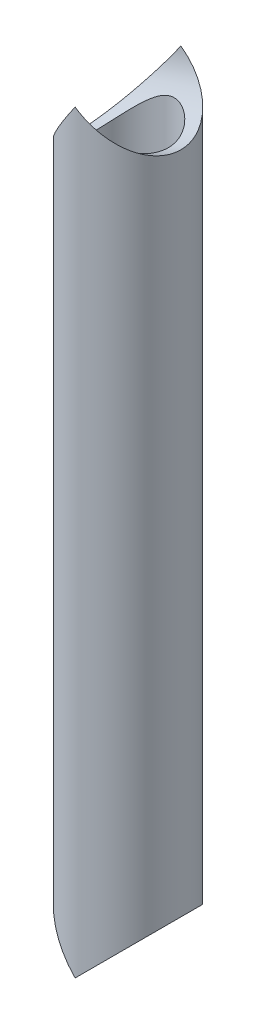
ISO-10303-21;
HEADER;
FILE_DESCRIPTION(('STEP AP214'),'2;1');
FILE_NAME('part.step','',(''),(''),'','','');
FILE_SCHEMA(('AUTOMOTIVE_DESIGN { 1 0 10303 214 1 1 1 1 }'));
ENDSEC;
DATA;
#1=APPLICATION_CONTEXT('core data for automotive mechanical design processes');
#2=APPLICATION_PROTOCOL_DEFINITION('international standard','automotive_design',2000,#1);
#3=PRODUCT_CONTEXT('',#1,'mechanical');
#4=PRODUCT('Part','Part','',(#3));
#5=PRODUCT_RELATED_PRODUCT_CATEGORY('part','',(#4));
#6=PRODUCT_DEFINITION_FORMATION('','',#4);
#7=PRODUCT_DEFINITION_CONTEXT('part definition',#1,'design');
#8=PRODUCT_DEFINITION('design','',#6,#7);
#9=PRODUCT_DEFINITION_SHAPE('','',#8);
#10=(LENGTH_UNIT() NAMED_UNIT(*) SI_UNIT(.MILLI.,.METRE.));
#11=(NAMED_UNIT(*) PLANE_ANGLE_UNIT() SI_UNIT($,.RADIAN.));
#12=(NAMED_UNIT(*) SI_UNIT($,.STERADIAN.) SOLID_ANGLE_UNIT());
#13=UNCERTAINTY_MEASURE_WITH_UNIT(LENGTH_MEASURE(1.E-05),#10,'distance_accuracy_value','');
#14=(GEOMETRIC_REPRESENTATION_CONTEXT(3) GLOBAL_UNCERTAINTY_ASSIGNED_CONTEXT((#13)) GLOBAL_UNIT_ASSIGNED_CONTEXT((#10,
#11,#12)) REPRESENTATION_CONTEXT('',''));
#15=CARTESIAN_POINT('',(0.,0.,0.));
#16=DIRECTION('',(0.,0.,1.));
#17=DIRECTION('',(1.,0.,0.));
#18=AXIS2_PLACEMENT_3D('',#15,#16,#17);
#19=CARTESIAN_POINT('',(2299.99999999996,181.249999999997,-275.000000000001));
#20=DIRECTION('',(0.,-1.,0.));
#21=DIRECTION('',(0.,0.,-1.));
#22=AXIS2_PLACEMENT_3D('',#19,#20,#21);
#23=CYLINDRICAL_SURFACE('',#22,12.6999999999999);
#24=CARTESIAN_POINT('',(2299.99999999996,181.249999999996,-275.000000000001));
#25=DIRECTION('',(0.818779373097968,-0.57410829831078,0.));
#26=DIRECTION('',(-0.574108298310781,-0.818779373097967,0.));
#27=AXIS2_PLACEMENT_3D('',#24,#25,#26);
#28=ELLIPSE('',#27,22.1212618548932,12.6999999999999);
#29=CARTESIAN_POINT('',(2299.99999999996,181.249999999997,-287.700000000001));
#30=VERTEX_POINT('',#29);
#31=CARTESIAN_POINT('',(2299.99999999996,181.249999999997,-262.300000000001));
#32=VERTEX_POINT('',#31);
#33=EDGE_CURVE('E56',#30,#32,#28,.F.);
#34=ORIENTED_EDGE('',*,*,#33,.F.);
#35=CARTESIAN_POINT('',(2299.99999999996,181.249999999996,-275.000000000001));
#36=DIRECTION('',(-0.574108298310781,-0.818779373097967,0.));
#37=DIRECTION('',(0.818779373097968,-0.57410829831078,0.));
#38=AXIS2_PLACEMENT_3D('',#35,#36,#37);
#39=ELLIPSE('',#38,15.5108939199918,12.6999999999999);
#40=EDGE_CURVE('E91',#32,#30,#39,.F.);
#41=ORIENTED_EDGE('',*,*,#40,.F.);
#42=EDGE_LOOP('',(#34,#41));
#43=FACE_BOUND('',#42,.T.);
#44=CARTESIAN_POINT('',(2299.99999999996,-1.51267887105178E-12,-275.000000000001));
#45=DIRECTION('',(0.70710678118655,-0.707106781186546,0.));
#46=DIRECTION('',(-0.707106781186546,-0.707106781186549,0.));
#47=AXIS2_PLACEMENT_3D('',#44,#45,#46);
#48=ELLIPSE('',#47,17.9605122421383,12.6999999999999);
#49=CARTESIAN_POINT('',(2299.99999999996,-1.5404344466674E-12,-287.700000000001));
#50=VERTEX_POINT('',#49);
#51=CARTESIAN_POINT('',(2299.99999999996,-4.16333634234434E-12,-262.300000000001));
#52=VERTEX_POINT('',#51);
#53=EDGE_CURVE('E73',#50,#52,#48,.T.);
#54=ORIENTED_EDGE('',*,*,#53,.F.);
#55=CARTESIAN_POINT('',(2299.99999999996,-1.51267887105178E-12,-275.000000000001));
#56=DIRECTION('',(-0.707106781186546,-0.707106781186549,0.));
#57=DIRECTION('',(0.70710678118655,-0.707106781186546,0.));
#58=AXIS2_PLACEMENT_3D('',#55,#56,#57);
#59=ELLIPSE('',#58,17.9605122421382,12.6999999999999);
#60=EDGE_CURVE('E80',#52,#50,#59,.T.);
#61=ORIENTED_EDGE('',*,*,#60,.F.);
#62=EDGE_LOOP('',(#54,#61));
#63=FACE_BOUND('',#62,.T.);
#64=ADVANCED_FACE('F42',(#43,#63),#23,.T.);
#65=CARTESIAN_POINT('',(1799.99999999996,-4.20496970576778E-12,-275.000000000001));
#66=DIRECTION('',(0.940136065162483,0.3407993236214,0.));
#67=DIRECTION('',(-0.3407993236214,0.940136065162483,0.));
#68=AXIS2_PLACEMENT_3D('',#65,#66,#67);
#69=CYLINDRICAL_SURFACE('',#68,12.7);
#70=CARTESIAN_POINT('',(2299.99999999996,172.467908247635,-284.650000000001));
#71=CARTESIAN_POINT('',(2299.73053482446,172.370218189027,-284.649997759306));
#72=CARTESIAN_POINT('',(2299.46554248098,172.260056766113,-284.638694372456));
#73=CARTESIAN_POINT('',(2298.94662265408,172.019153605129,-284.595878168783));
#74=CARTESIAN_POINT('',(2298.69270935676,171.888386416019,-284.564340209438));
#75=CARTESIAN_POINT('',(2298.1952072461,171.610087485636,-284.483098979186));
#76=CARTESIAN_POINT('',(2297.95169548143,171.46245317265,-284.433279994711));
#77=CARTESIAN_POINT('',(2297.4764958178,171.15532292964,-284.317415065042));
#78=CARTESIAN_POINT('',(2297.24480572008,170.99582921905,-284.251372150784));
#79=CARTESIAN_POINT('',(2296.70031175359,170.60176101783,-284.07450685215));
#80=CARTESIAN_POINT('',(2296.39287128243,170.36304733443,-283.956398954751));
#81=CARTESIAN_POINT('',(2295.79746676399,169.876438195739,-283.692940414183));
#82=CARTESIAN_POINT('',(2295.50951387501,169.628537603784,-283.547574340008));
#83=CARTESIAN_POINT('',(2294.95184407707,169.129663568345,-283.230515777692));
#84=CARTESIAN_POINT('',(2294.68211252106,168.878692789196,-283.058844806216));
#85=CARTESIAN_POINT('',(2294.16001321391,168.378499187879,-282.688911920102));
#86=CARTESIAN_POINT('',(2293.9076385082,168.129275701977,-282.490660750671));
#87=CARTESIAN_POINT('',(2293.46834534704,167.685553799704,-282.108252687632));
#88=CARTESIAN_POINT('',(2293.27830943162,167.489924907236,-281.928981075182));
#89=CARTESIAN_POINT('',(2292.91021399962,167.105291024418,-281.551861442901));
#90=CARTESIAN_POINT('',(2292.73215545709,166.916286573392,-281.354011915367));
#91=CARTESIAN_POINT('',(2292.38954262194,166.548141986001,-280.939324997215));
#92=CARTESIAN_POINT('',(2292.22496102757,166.368982161477,-280.722527931348));
#93=CARTESIAN_POINT('',(2291.91073877806,166.023518665575,-280.269013329519));
#94=CARTESIAN_POINT('',(2291.76109145339,165.857209262865,-280.032304773692));
#95=CARTESIAN_POINT('',(2291.42811875588,165.484212809176,-279.449133380189));
#96=CARTESIAN_POINT('',(2291.25201934174,165.28449610461,-279.093800231935));
#97=CARTESIAN_POINT('',(2291.01788618172,165.017004988662,-278.533432042647));
#98=CARTESIAN_POINT('',(2290.94485426117,164.93320005845,-278.342115872068));
#99=CARTESIAN_POINT('',(2290.80987402723,164.777818732797,-277.950741999339));
#100=CARTESIAN_POINT('',(2290.74792389831,164.706240334358,-277.750685735781));
#101=CARTESIAN_POINT('',(2290.64532866594,164.587410751901,-277.375727045156));
#102=CARTESIAN_POINT('',(2290.60285878446,164.53809782102,-277.201974600978));
#103=CARTESIAN_POINT('',(2290.52724317586,164.450159626415,-276.849808707908));
#104=CARTESIAN_POINT('',(2290.49409554138,164.411532176434,-276.671396220652));
#105=CARTESIAN_POINT('',(2290.43772976295,164.345777021796,-276.311004460584));
#106=CARTESIAN_POINT('',(2290.41450644775,164.318643328177,-276.129027097142));
#107=CARTESIAN_POINT('',(2290.37842269942,164.276458788866,-275.762646568441));
#108=CARTESIAN_POINT('',(2290.365562346,164.261408036111,-275.578243384535));
#109=CARTESIAN_POINT('',(2290.35045422322,164.243724881254,-275.207875761226));
#110=CARTESIAN_POINT('',(2290.34823683894,164.241128034375,-275.021908368404));
#111=CARTESIAN_POINT('',(2290.3545451394,164.248513004529,-274.650407901026));
#112=CARTESIAN_POINT('',(2290.36307085271,164.258494855011,-274.464874827626));
#113=CARTESIAN_POINT('',(2290.39068647275,164.290798807495,-274.095631182327));
#114=CARTESIAN_POINT('',(2290.40977958537,164.313124654349,-273.911921180728));
#115=CARTESIAN_POINT('',(2290.45814082542,164.36959754008,-273.547698809239));
#116=CARTESIAN_POINT('',(2290.48740903575,164.403744675258,-273.367186465411));
#117=CARTESIAN_POINT('',(2290.55434681284,164.481697765372,-273.01687371838));
#118=CARTESIAN_POINT('',(2290.59167801869,164.525114076771,-272.846921196638));
#119=CARTESIAN_POINT('',(2290.67470231858,164.62145879688,-272.51179726154));
#120=CARTESIAN_POINT('',(2290.7203979906,164.674390138094,-272.346627340442));
#121=CARTESIAN_POINT('',(2290.8690598963,164.846137884352,-271.859354085998));
#122=CARTESIAN_POINT('',(2290.98363651566,164.977949601629,-271.545306792955));
#123=CARTESIAN_POINT('',(2291.31041125978,165.35107940232,-270.772028486017));
#124=CARTESIAN_POINT('',(2291.54129786457,165.612324908465,-270.33030385345));
#125=CARTESIAN_POINT('',(2291.92329019123,166.037194799253,-269.713398596103));
#126=CARTESIAN_POINT('',(2292.05684633344,166.184623291186,-269.515051232876));
#127=CARTESIAN_POINT('',(2292.33466133954,166.488321702911,-269.133078115759));
#128=CARTESIAN_POINT('',(2292.47891986943,166.644591346763,-268.94945190284));
#129=CARTESIAN_POINT('',(2292.84455761016,167.036171481727,-268.516565852519));
#130=CARTESIAN_POINT('',(2293.0712854897,167.275238390509,-268.275225365091));
#131=CARTESIAN_POINT('',(2293.54309049028,167.76229425933,-267.820995665739));
#132=CARTESIAN_POINT('',(2293.78817765643,168.010288064522,-267.608122209324));
#133=CARTESIAN_POINT('',(2294.29602912652,168.510492327589,-267.209523819256));
#134=CARTESIAN_POINT('',(2294.55880902725,168.762706354603,-267.023823309438));
#135=CARTESIAN_POINT('',(2295.10199813402,169.266241985688,-266.679210978262));
#136=CARTESIAN_POINT('',(2295.3823999999,169.517563915863,-266.520288103288));
#137=CARTESIAN_POINT('',(2295.88312564491,169.946335024737,-266.26905215604));
#138=CARTESIAN_POINT('',(2296.09901438737,170.125262695582,-266.170385637131));
#139=CARTESIAN_POINT('',(2296.54158878963,170.477335026015,-265.987829743365));
#140=CARTESIAN_POINT('',(2296.76827515228,170.650479307888,-265.903941332144));
#141=CARTESIAN_POINT('',(2297.23271049986,170.987508301407,-265.752072536941));
#142=CARTESIAN_POINT('',(2297.47043127628,171.151414482954,-265.684054007376));
#143=CARTESIAN_POINT('',(2297.95819292835,171.466641412139,-265.565145386283));
#144=CARTESIAN_POINT('',(2298.20822810032,171.617967900637,-265.514247448949));
#145=CARTESIAN_POINT('',(2298.63986546246,171.858377782197,-265.444685248814));
#146=CARTESIAN_POINT('',(2298.8181143464,171.952015177421,-265.420917602166));
#147=CARTESIAN_POINT('',(2299.18032461408,172.129673692137,-265.383151750566));
#148=CARTESIAN_POINT('',(2299.36428407882,172.213697998511,-265.369150300084));
#149=CARTESIAN_POINT('',(2299.73718388123,172.370416599529,-265.351777100898));
#150=CARTESIAN_POINT('',(2299.92611672571,172.443126912917,-265.348390191191));
#151=CARTESIAN_POINT('',(2300.30827256465,172.575886347668,-265.35303313427));
#152=CARTESIAN_POINT('',(2300.50149544033,172.635935819132,-265.361062671318));
#153=CARTESIAN_POINT('',(2300.89241144788,172.742704146845,-265.389339259386));
#154=CARTESIAN_POINT('',(2301.09012801355,172.789312119353,-265.409683871265));
#155=CARTESIAN_POINT('',(2301.48672693155,172.868035297717,-265.463115115684));
#156=CARTESIAN_POINT('',(2301.68560928388,172.90015050359,-265.496201748208));
#157=CARTESIAN_POINT('',(2302.08273056967,172.950131055175,-265.57525856253));
#158=CARTESIAN_POINT('',(2302.2809689797,172.967986791114,-265.621237404525));
#159=CARTESIAN_POINT('',(2302.6748151356,172.990337576116,-265.725875317573));
#160=CARTESIAN_POINT('',(2302.87042282271,172.994832327219,-265.784534671379));
#161=CARTESIAN_POINT('',(2303.23962355314,172.992041803571,-265.908153032472));
#162=CARTESIAN_POINT('',(2303.41358786701,172.985801033579,-265.972037872669));
#163=CARTESIAN_POINT('',(2303.75713296598,172.964784037057,-266.109514572788));
#164=CARTESIAN_POINT('',(2303.92671213693,172.950004712946,-266.183109947975));
#165=CARTESIAN_POINT('',(2304.42784557373,172.894881000918,-266.41788967582));
#166=CARTESIAN_POINT('',(2304.75180715099,172.843750616685,-266.593071461264));
#167=CARTESIAN_POINT('',(2305.29455959348,172.738691671621,-266.927569865762));
#168=CARTESIAN_POINT('',(2305.51894260648,172.688877981324,-267.079345713224));
#169=CARTESIAN_POINT('',(2305.9533140424,172.582717481231,-267.400431113796));
#170=CARTESIAN_POINT('',(2306.1632974197,172.526368399866,-267.569746761184));
#171=CARTESIAN_POINT('',(2306.56805994898,172.410216054049,-267.924994202727));
#172=CARTESIAN_POINT('',(2306.76282201821,172.350409036068,-268.110944177614));
#173=CARTESIAN_POINT('',(2307.1360210879,172.230065475426,-268.498306765165));
#174=CARTESIAN_POINT('',(2307.31445975823,172.169529008104,-268.69971779229));
#175=CARTESIAN_POINT('',(2307.65542013288,172.04955086513,-269.118627955483));
#176=CARTESIAN_POINT('',(2307.81780830623,171.990121251027,-269.336239300013));
#177=CARTESIAN_POINT('',(2308.12407224244,171.874876942633,-269.785045492319));
#178=CARTESIAN_POINT('',(2308.26794760491,171.819062326536,-270.01624063372));
#179=CARTESIAN_POINT('',(2308.53601675936,171.712858274085,-270.490773445517));
#180=CARTESIAN_POINT('',(2308.6602231113,171.662465382248,-270.734103235526));
#181=CARTESIAN_POINT('',(2308.88797143843,171.568601012514,-271.231541280481));
#182=CARTESIAN_POINT('',(2308.99151404021,171.525129324751,-271.485649208313));
#183=CARTESIAN_POINT('',(2309.17596447705,171.446803545576,-272.000309645774));
#184=CARTESIAN_POINT('',(2309.25708937214,171.411867223489,-272.260771700066));
#185=CARTESIAN_POINT('',(2309.39717759498,171.351074650212,-272.788640060479));
#186=CARTESIAN_POINT('',(2309.45614087054,171.325218420398,-273.056046382947));
#187=CARTESIAN_POINT('',(2309.55118338372,171.283354255913,-273.595577187641));
#188=CARTESIAN_POINT('',(2309.58726964824,171.267343297212,-273.867700194679));
#189=CARTESIAN_POINT('',(2309.63612579955,171.245633474846,-274.414432680925));
#190=CARTESIAN_POINT('',(2309.64889736631,171.239933868183,-274.689041979547));
#191=CARTESIAN_POINT('',(2309.65088296246,171.239048242282,-275.216286119155));
#192=CARTESIAN_POINT('',(2309.64190620818,171.243054778942,-275.468914908257));
#193=CARTESIAN_POINT('',(2309.60420102593,171.25982506276,-275.972388783244));
#194=CARTESIAN_POINT('',(2309.57547380336,171.272588275492,-276.223233977039));
#195=CARTESIAN_POINT('',(2309.49858332921,171.306549698006,-276.721310895051));
#196=CARTESIAN_POINT('',(2309.4504222859,171.327746949419,-276.968543026516));
#197=CARTESIAN_POINT('',(2309.33516071545,171.378048039254,-277.457727559054));
#198=CARTESIAN_POINT('',(2309.26805983618,171.407152024675,-277.699679861876));
#199=CARTESIAN_POINT('',(2309.11609287312,171.472318525363,-278.175090948703));
#200=CARTESIAN_POINT('',(2309.03135271699,171.508331580853,-278.408596860839));
#201=CARTESIAN_POINT('',(2308.84456786848,171.586563518522,-278.867491595145));
#202=CARTESIAN_POINT('',(2308.7425233619,171.628782334068,-279.092880504438));
#203=CARTESIAN_POINT('',(2308.52188363618,171.718402201551,-279.534416350076));
#204=CARTESIAN_POINT('',(2308.40328306147,171.765804929307,-279.750560266165));
#205=CARTESIAN_POINT('',(2308.15035595184,171.864588914034,-280.172495483765));
#206=CARTESIAN_POINT('',(2308.01602824801,171.915970466636,-280.378286014133));
#207=CARTESIAN_POINT('',(2307.72198117068,172.025241981729,-280.793347092175));
#208=CARTESIAN_POINT('',(2307.56112013454,172.083332540011,-281.001756696156));
#209=CARTESIAN_POINT('',(2307.22308401382,172.200635477715,-281.404584734734));
#210=CARTESIAN_POINT('',(2307.04590728267,172.259847969885,-281.599001753662));
#211=CARTESIAN_POINT('',(2306.67602514394,172.377219563241,-281.972975644404));
#212=CARTESIAN_POINT('',(2306.48331318166,172.435378206973,-282.152526178222));
#213=CARTESIAN_POINT('',(2306.0832488222,172.548061362866,-282.495733766435));
#214=CARTESIAN_POINT('',(2305.87589869451,172.602586435834,-282.65939327525));
#215=CARTESIAN_POINT('',(2305.47957070307,172.697326296517,-282.946531596886));
#216=CARTESIAN_POINT('',(2305.29250807008,172.738460546252,-283.072354015057));
#217=CARTESIAN_POINT('',(2304.9090248277,172.8138345128,-283.311135434399));
#218=CARTESIAN_POINT('',(2304.71260588048,172.848075448621,-283.424096708387));
#219=CARTESIAN_POINT('',(2304.31147985033,172.907271483493,-283.636263101621));
#220=CARTESIAN_POINT('',(2304.10678568848,172.932240482794,-283.735488671849));
#221=CARTESIAN_POINT('',(2303.68996362096,172.970437408307,-283.919558771418));
#222=CARTESIAN_POINT('',(2303.47783756582,172.98366823601,-284.004406850452));
#223=CARTESIAN_POINT('',(2303.08608674462,172.994805726513,-284.145153786568));
#224=CARTESIAN_POINT('',(2302.90741147709,172.995024265337,-284.203516869633));
#225=CARTESIAN_POINT('',(2302.54726008047,172.984624801551,-284.309628681743));
#226=CARTESIAN_POINT('',(2302.36578458159,172.974009203211,-284.357379762901));
#227=CARTESIAN_POINT('',(2302.00158871129,172.941034164224,-284.441983273501));
#228=CARTESIAN_POINT('',(2301.81887013265,172.918689094121,-284.478848953192));
#229=CARTESIAN_POINT('',(2301.45352041814,172.861792199778,-284.541704668761));
#230=CARTESIAN_POINT('',(2301.2708892728,172.827244186212,-284.567698094244));
#231=CARTESIAN_POINT('',(2300.90500623726,172.745502459949,-284.609253783223));
#232=CARTESIAN_POINT('',(2300.72177211717,172.698165416768,-284.624690345882));
#233=CARTESIAN_POINT('',(2300.35837474745,172.591667069626,-284.645060112606));
#234=CARTESIAN_POINT('',(2300.17820921882,172.532514996919,-284.650001481872));
#235=CARTESIAN_POINT('',(2299.99999999996,172.467908247635,-284.650000000001));
#236=B_SPLINE_CURVE_WITH_KNOTS('',3,(#70,#71,#72,#73,#74,#75,#76,#77,#78,#79,#80,#81,#82,#83,
#84,#85,#86,#87,#88,#89,#90,#91,#92,#93,#94,#95,#96,#97,#98,#99,#100,#101,#102,#103,#104,#105,
#106,#107,#108,#109,#110,#111,#112,#113,#114,#115,#116,#117,#118,#119,#120,#121,#122,#123,#124,
#125,#126,#127,#128,#129,#130,#131,#132,#133,#134,#135,#136,#137,#138,#139,#140,#141,#142,#143,
#144,#145,#146,#147,#148,#149,#150,#151,#152,#153,#154,#155,#156,#157,#158,#159,#160,#161,#162,
#163,#164,#165,#166,#167,#168,#169,#170,#171,#172,#173,#174,#175,#176,#177,#178,#179,#180,#181,
#182,#183,#184,#185,#186,#187,#188,#189,#190,#191,#192,#193,#194,#195,#196,#197,#198,#199,#200,
#201,#202,#203,#204,#205,#206,#207,#208,#209,#210,#211,#212,#213,#214,#215,#216,#217,#218,#219,
#220,#221,#222,#223,#224,#225,#226,#227,#228,#229,#230,#231,#232,#233,#234,#235),.UNSPECIFIED.,
.T.,.F.,(4,2,2,2,2,2,2,2,2,2,2,2,2,2,2,2,2,2,2,2,2,2,2,2,2,2,2,2,2,2,2,2,2,2,2,2,2,2,2,2,2,2,2,
2,2,2,2,2,2,2,2,2,2,2,2,2,2,2,2,2,2,2,2,2,2,2,2,2,2,2,2,2,2,2,2,2,2,2,2,2,2,2,4),(0.,
0.85956480092131,1.72019973033594,2.58637893968347,3.45239645340109,4.67086270441151,
5.89002082984862,7.10818698994395,8.32586217554469,9.30426642642538,10.2827501491396,
11.2591999090223,12.2352116246843,13.5620039284862,14.2251760081481,14.8882393400177,
15.4443119321435,16.0002706671357,16.555939355651,17.111612318181,17.6688707561132,
18.2261306758476,18.7835597467798,19.340993358886,19.8784665437069,20.4161056610598,
21.4908238050822,23.1690661221741,24.0113241392334,24.8535558831466,26.0770645424319,
27.3012475929254,28.5265243035212,29.7512939829841,30.6425157624065,31.5337956343069,
32.4229105913923,33.3116175392895,33.9193878144768,34.5269560173332,35.1336560195331,
35.7403392429389,36.3518927260381,36.9634462083925,37.5754114831919,38.1873904051506,
38.7431350958184,39.2990815239091,40.4109386475581,41.2363370250298,42.0620231588261,
42.8886230295086,43.7151382448649,44.5480349241406,45.3809496137405,46.2133302688706,
47.0456856795554,47.8696743510834,48.6936649623993,49.5174023536227,50.3410803869932,
51.0986209696201,51.8561153230385,52.6135236262341,53.370946011955,54.1231359800807,
54.8753178723953,55.6277436475559,56.3802253823081,57.1881546687048,57.9961655810247,
58.8045192159797,59.6127477989008,60.2996371955591,60.986405016436,61.6721390557604,
62.3577035451617,62.9210191383646,63.4842097498882,64.0467119646701,64.6090386790996,
65.1779496080388,65.74641776516),.UNSPECIFIED.);
#237=CARTESIAN_POINT('',(2299.99999999996,172.467908247635,-284.650000000001));
#238=VERTEX_POINT('',#237);
#239=EDGE_CURVE('E11',#238,#238,#236,.T.);
#240=ORIENTED_EDGE('',*,*,#239,.F.);
#241=EDGE_LOOP('',(#240));
#242=FACE_BOUND('',#241,.T.);
#243=ORIENTED_EDGE('',*,*,#33,.T.);
#244=ORIENTED_EDGE('',*,*,#40,.T.);
#245=EDGE_LOOP('',(#243,#244));
#246=FACE_BOUND('',#245,.T.);
#247=ADVANCED_FACE('F100',(#242,#246),#69,.F.);
#248=CARTESIAN_POINT('',(1799.99999999996,-4.12170297892089E-12,-275.000000000001));
#249=DIRECTION('',(1.,0.,0.));
#250=DIRECTION('',(0.,1.,0.));
#251=AXIS2_PLACEMENT_3D('',#248,#249,#250);
#252=CYLINDRICAL_SURFACE('',#251,12.7);
#253=CARTESIAN_POINT('',(2299.99999999996,8.25636118395842,-284.650000000001));
#254=CARTESIAN_POINT('',(2300.2238809479,8.25636650160305,-284.649997471153));
#255=CARTESIAN_POINT('',(2300.44779598858,8.26552111122355,-284.642185976445));
#256=CARTESIAN_POINT('',(2300.89312189135,8.30155650462335,-284.611175788682));
#257=CARTESIAN_POINT('',(2301.11453214946,8.32844147486633,-284.587973461561));
#258=CARTESIAN_POINT('',(2301.55330914591,8.39840451080104,-284.526749222472));
#259=CARTESIAN_POINT('',(2301.7706625495,8.44152854567089,-284.488685229058));
#260=CARTESIAN_POINT('',(2302.19920636251,8.54169432810287,-284.398615818278));
#261=CARTESIAN_POINT('',(2302.41039430787,8.59874155714344,-284.346604909298));
#262=CARTESIAN_POINT('',(2302.86846446711,8.73719433783208,-284.217490354832));
#263=CARTESIAN_POINT('',(2303.11372202509,8.82119710367517,-284.13742362549));
#264=CARTESIAN_POINT('',(2303.59306589356,9.00156935271057,-283.959785989283));
#265=CARTESIAN_POINT('',(2303.82714896829,9.09794238847478,-283.862210050796));
#266=CARTESIAN_POINT('',(2304.28407961302,9.29939516527677,-283.650584442118));
#267=CARTESIAN_POINT('',(2304.50691688092,9.40448266467971,-283.536520023855));
#268=CARTESIAN_POINT('',(2304.94106326866,9.62008904980574,-283.292789857837));
#269=CARTESIAN_POINT('',(2305.15237338134,9.73060746620049,-283.163125456802));
#270=CARTESIAN_POINT('',(2305.56830672249,9.95702736946201,-282.885458668398));
#271=CARTESIAN_POINT('',(2305.77265217323,10.0729943631192,-282.737094058676));
#272=CARTESIAN_POINT('',(2306.16900131329,10.3052560033119,-282.424927970279));
#273=CARTESIAN_POINT('',(2306.36100460787,10.4215506602032,-282.261125998283));
#274=CARTESIAN_POINT('',(2306.73207460018,10.6520993133467,-281.91848178545));
#275=CARTESIAN_POINT('',(2306.91115144745,10.7663548564068,-281.739651588531));
#276=CARTESIAN_POINT('',(2307.25584339355,10.9907989746195,-281.367074058027));
#277=CARTESIAN_POINT('',(2307.42145912612,11.1009877410927,-281.173327427507));
#278=CARTESIAN_POINT('',(2307.73163925038,11.3107584124202,-280.779652355224));
#279=CARTESIAN_POINT('',(2307.87679554221,11.4105914116386,-280.58032497267));
#280=CARTESIAN_POINT('',(2308.15284148754,11.6028668966314,-280.168662733001));
#281=CARTESIAN_POINT('',(2308.2837332496,11.6953104741548,-279.956329805607));
#282=CARTESIAN_POINT('',(2308.53006644363,11.8710609081059,-279.519225052687));
#283=CARTESIAN_POINT('',(2308.64550703063,11.9543672648045,-279.294452547831));
#284=CARTESIAN_POINT('',(2308.85958379957,12.1100921094653,-278.833388187829));
#285=CARTESIAN_POINT('',(2308.95822011415,12.1825106833701,-278.597096423631));
#286=CARTESIAN_POINT('',(2309.13812450243,12.3154012305782,-278.112025500927));
#287=CARTESIAN_POINT('',(2309.21922217784,12.3757555998474,-277.863150502245));
#288=CARTESIAN_POINT('',(2309.36148671678,12.4820951324542,-277.356740010992));
#289=CARTESIAN_POINT('',(2309.42265328476,12.5280800827093,-277.099204390056));
#290=CARTESIAN_POINT('',(2309.52380445426,12.6043344622585,-276.577987368538));
#291=CARTESIAN_POINT('',(2309.56381126087,12.6346203654824,-276.314312714946));
#292=CARTESIAN_POINT('',(2309.62187152846,12.6786256550751,-275.783203892268));
#293=CARTESIAN_POINT('',(2309.63992898451,12.6923480562058,-275.515770416301));
#294=CARTESIAN_POINT('',(2309.65264386903,12.7020088617574,-275.021175400174));
#295=CARTESIAN_POINT('',(2309.65046784581,12.7003538689969,-274.79413372961));
#296=CARTESIAN_POINT('',(2309.63015326612,12.6849243541179,-274.341198970451));
#297=CARTESIAN_POINT('',(2309.61201665637,12.6711513100522,-274.115305745158));
#298=CARTESIAN_POINT('',(2309.56007469284,12.6317948960897,-273.666381089012));
#299=CARTESIAN_POINT('',(2309.52626931532,12.606211508297,-273.443349662496));
#300=CARTESIAN_POINT('',(2309.44350913262,12.5437883797093,-273.00172338559));
#301=CARTESIAN_POINT('',(2309.39455392064,12.5069483366488,-272.783128654502));
#302=CARTESIAN_POINT('',(2309.28397177702,12.4241029996189,-272.358607568935));
#303=CARTESIAN_POINT('',(2309.2227951782,12.378424859462,-272.152499248937));
#304=CARTESIAN_POINT('',(2309.08760165531,12.2780272819771,-271.746732946512));
#305=CARTESIAN_POINT('',(2309.01358031607,12.2233047360879,-271.547077210142));
#306=CARTESIAN_POINT('',(2308.85351814761,12.1057562302849,-271.155197630732));
#307=CARTESIAN_POINT('',(2308.76748087384,12.0429326678354,-270.962971610684));
#308=CARTESIAN_POINT('',(2308.58412444449,11.9101090414245,-270.586478532353));
#309=CARTESIAN_POINT('',(2308.48680124829,11.8401064082424,-270.402214357194));
#310=CARTESIAN_POINT('',(2308.26814620199,11.6843101232695,-270.018512269001));
#311=CARTESIAN_POINT('',(2308.14534017242,11.5976504909959,-269.820265801703));
#312=CARTESIAN_POINT('',(2307.88721125462,11.4178378866164,-269.435093917832));
#313=CARTESIAN_POINT('',(2307.75188304738,11.3246821593599,-269.248173368441));
#314=CARTESIAN_POINT('',(2307.46946263948,11.1332644182827,-268.885882271667));
#315=CARTESIAN_POINT('',(2307.32235896641,11.0349974582244,-268.710523299163));
#316=CARTESIAN_POINT('',(2307.01725064134,10.8349454704604,-268.371829999691));
#317=CARTESIAN_POINT('',(2306.85924881123,10.7331613568393,-268.208492582431));
#318=CARTESIAN_POINT('',(2306.49945938943,10.5065279577586,-267.861788650838));
#319=CARTESIAN_POINT('',(2306.295323438,10.3812168353868,-267.681152848841));
#320=CARTESIAN_POINT('',(2305.87255427908,10.1304200601689,-267.337767354395));
#321=CARTESIAN_POINT('',(2305.65391758764,10.0049343725236,-267.175021985438));
#322=CARTESIAN_POINT('',(2305.20247270437,9.75692814531907,-266.867885866329));
#323=CARTESIAN_POINT('',(2304.96966483976,9.63440753738503,-266.7234946926));
#324=CARTESIAN_POINT('',(2304.49016381972,9.39605116186092,-266.453852671959));
#325=CARTESIAN_POINT('',(2304.24347572457,9.2802129888704,-266.328594910715));
#326=CARTESIAN_POINT('',(2303.62370514064,9.01055914500794,-266.047202974483));
#327=CARTESIAN_POINT('',(2303.24290764359,8.86255803907158,-265.901855106179));
#328=CARTESIAN_POINT('',(2302.65189314292,8.66980372388422,-265.719244871426));
#329=CARTESIAN_POINT('',(2302.45173328474,8.61045838748207,-265.664302996782));
#330=CARTESIAN_POINT('',(2302.04523823548,8.50365137150217,-265.566913154354));
#331=CARTESIAN_POINT('',(2301.83890426745,8.45618735549764,-265.524462729875));
#332=CARTESIAN_POINT('',(2301.45431956732,8.3816947351774,-265.458550180121));
#333=CARTESIAN_POINT('',(2301.27679652053,8.35262020016663,-265.433145556601));
#334=CARTESIAN_POINT('',(2300.91917999003,8.30548031772598,-265.39219180822));
#335=CARTESIAN_POINT('',(2300.73908705287,8.28741266406855,-265.376640618782));
#336=CARTESIAN_POINT('',(2300.37762651766,8.26302688231353,-265.355693440158));
#337=CARTESIAN_POINT('',(2300.19625980511,8.25670127345301,-265.35029098527));
#338=CARTESIAN_POINT('',(2299.83348362387,8.25604788289179,-265.3497319337));
#339=CARTESIAN_POINT('',(2299.65207415426,8.26172039198434,-265.354575585349));
#340=CARTESIAN_POINT('',(2299.29091129821,8.28479826519297,-265.374391221174));
#341=CARTESIAN_POINT('',(2299.11115545643,8.30218175487692,-265.389344322532));
#342=CARTESIAN_POINT('',(2298.7541674946,8.34794875853338,-265.429071960344));
#343=CARTESIAN_POINT('',(2298.57693537882,8.37633229107087,-265.453846513374));
#344=CARTESIAN_POINT('',(2298.22573020293,8.44308943787645,-265.512839201216));
#345=CARTESIAN_POINT('',(2298.05176178097,8.48147626238905,-265.547069827238));
#346=CARTESIAN_POINT('',(2297.70799504505,8.56697417067242,-265.624485259924));
#347=CARTESIAN_POINT('',(2297.53819791417,8.61408769794838,-265.667672574897));
#348=CARTESIAN_POINT('',(2297.12447740184,8.73962656542303,-265.784830008542));
#349=CARTESIAN_POINT('',(2296.8832436018,8.82235793134378,-265.863725585581));
#350=CARTESIAN_POINT('',(2296.41155733376,8.99981069173787,-266.038476052039));
#351=CARTESIAN_POINT('',(2296.18111006207,9.09453778524623,-266.134339011136));
#352=CARTESIAN_POINT('',(2295.73088996493,9.29257029218158,-266.342126624723));
#353=CARTESIAN_POINT('',(2295.51113673912,9.39589058091654,-266.454079386058));
#354=CARTESIAN_POINT('',(2295.0828227744,9.60788792873918,-266.693134423815));
#355=CARTESIAN_POINT('',(2294.8742606252,9.71656430953536,-266.820234784832));
#356=CARTESIAN_POINT('',(2294.46054389006,9.94091141867814,-267.094253325404));
#357=CARTESIAN_POINT('',(2294.25582857462,10.0566904184988,-267.241745548556));
#358=CARTESIAN_POINT('',(2293.85869660894,10.2886901779402,-267.552154083836));
#359=CARTESIAN_POINT('',(2293.66628064026,10.4049109616643,-267.715071249479));
#360=CARTESIAN_POINT('',(2293.29436069032,10.6354044939347,-268.055904695521));
#361=CARTESIAN_POINT('',(2293.11484480299,10.749678962507,-268.233806807409));
#362=CARTESIAN_POINT('',(2292.76914131129,10.9743134887968,-268.604576575237));
#363=CARTESIAN_POINT('',(2292.6029580735,11.0846722575293,-268.797449093801));
#364=CARTESIAN_POINT('',(2292.29102235073,11.2952697991767,-269.190129443297));
#365=CARTESIAN_POINT('',(2292.14473046355,11.3957344296568,-269.389386815747));
#366=CARTESIAN_POINT('',(2291.86644430119,11.5893157638869,-269.801012469891));
#367=CARTESIAN_POINT('',(2291.73444788075,11.6824335695763,-270.013378776847));
#368=CARTESIAN_POINT('',(2291.48602134663,11.8595003557766,-270.45051367823));
#369=CARTESIAN_POINT('',(2291.36958199476,11.9434547722691,-270.675274799258));
#370=CARTESIAN_POINT('',(2291.15353976976,12.100489847021,-271.136396485112));
#371=CARTESIAN_POINT('',(2291.05393409963,12.1735723114707,-271.372755114515));
#372=CARTESIAN_POINT('',(2290.88647319918,12.2972021624835,-271.81970562566));
#373=CARTESIAN_POINT('',(2290.81609786775,12.3494849992028,-272.028875494399));
#374=CARTESIAN_POINT('',(2290.68938395762,12.4440061327461,-272.453625298769));
#375=CARTESIAN_POINT('',(2290.63304295173,12.4862461663767,-272.669204118768));
#376=CARTESIAN_POINT('',(2290.53516759604,12.5598372396133,-273.105431274593));
#377=CARTESIAN_POINT('',(2290.49362666938,12.5911931157549,-273.326077312136));
#378=CARTESIAN_POINT('',(2290.42592945134,12.6423825053804,-273.77105145885));
#379=CARTESIAN_POINT('',(2290.39977333548,12.6622158874029,-273.995379610002));
#380=CARTESIAN_POINT('',(2290.36320844145,12.6899609443247,-274.446695398274));
#381=CARTESIAN_POINT('',(2290.35284434057,12.6978387955096,-274.673688756615));
#382=CARTESIAN_POINT('',(2290.3481751738,12.7013865427146,-275.12793730875));
#383=CARTESIAN_POINT('',(2290.35387013945,12.6970564147694,-275.355192503058));
#384=CARTESIAN_POINT('',(2290.38122639794,12.6762860025406,-275.80820535951));
#385=CARTESIAN_POINT('',(2290.40288965421,12.6598442290505,-276.033962834053));
#386=CARTESIAN_POINT('',(2290.46183636499,12.6152168058431,-276.482242579319));
#387=CARTESIAN_POINT('',(2290.49911961789,12.5870313077139,-276.704764891762));
#388=CARTESIAN_POINT('',(2290.58686064145,12.5209383638381,-277.135800784473));
#389=CARTESIAN_POINT('',(2290.63670177084,12.4834871381322,-277.344510902725));
#390=CARTESIAN_POINT('',(2290.74958136652,12.3990460013952,-277.756424753405));
#391=CARTESIAN_POINT('',(2290.81262440323,12.3520527871496,-277.959626551293));
#392=CARTESIAN_POINT('',(2290.95115300241,12.2493661659144,-278.359407037535));
#393=CARTESIAN_POINT('',(2291.02663547874,12.1936749170194,-278.555987354097));
#394=CARTESIAN_POINT('',(2291.18931660253,12.0744597532247,-278.941854978068));
#395=CARTESIAN_POINT('',(2291.27651951303,12.0109329890162,-279.131139599435));
#396=CARTESIAN_POINT('',(2291.47155112331,11.870001273722,-279.521108768999));
#397=CARTESIAN_POINT('',(2291.58058290692,11.7918397886643,-279.720917967532));
#398=CARTESIAN_POINT('',(2291.8110636258,11.6283951565767,-280.110287204058));
#399=CARTESIAN_POINT('',(2291.93251775613,11.543109032759,-280.299842902927));
#400=CARTESIAN_POINT('',(2292.18698850641,11.3667159632159,-280.66828905598));
#401=CARTESIAN_POINT('',(2292.32000977782,11.2756066797832,-280.847175170437));
#402=CARTESIAN_POINT('',(2292.59683495495,11.0889092508834,-281.193938863954));
#403=CARTESIAN_POINT('',(2292.74064020531,10.9933205474422,-281.361815065292));
#404=CARTESIAN_POINT('',(2293.06803480299,10.779671749515,-281.718636600715));
#405=CARTESIAN_POINT('',(2293.25384888645,10.6609229956605,-281.905133270261));
#406=CARTESIAN_POINT('',(2293.63932210958,10.4212724909291,-282.261765948333));
#407=CARTESIAN_POINT('',(2293.83898381632,10.3003703439609,-282.431898909332));
#408=CARTESIAN_POINT('',(2294.25177181474,10.0589052180191,-282.755592608363));
#409=CARTESIAN_POINT('',(2294.46490697409,9.93834251813471,-282.90914224806));
#410=CARTESIAN_POINT('',(2294.90425132127,9.70051680113902,-283.19909181584));
#411=CARTESIAN_POINT('',(2295.13045792549,9.58325313873452,-283.335495116113));
#412=CARTESIAN_POINT('',(2295.55465379377,9.37554010230663,-283.567908947777));
#413=CARTESIAN_POINT('',(2295.75054553921,9.28401981570636,-283.666794833639));
#414=CARTESIAN_POINT('',(2296.15113330312,9.10763061532469,-283.851972087268));
#415=CARTESIAN_POINT('',(2296.35582946437,9.02276180946865,-283.938263250696));
#416=CARTESIAN_POINT('',(2296.77349996583,8.86231895471071,-284.09736499116));
#417=CARTESIAN_POINT('',(2296.98645924997,8.78672895755584,-284.170198810504));
#418=CARTESIAN_POINT('',(2297.42050442695,8.64749185276201,-284.301616063244));
#419=CARTESIAN_POINT('',(2297.64158677035,8.58383960131772,-284.360205637524));
#420=CARTESIAN_POINT('',(2298.03805424514,8.48463672046878,-284.45009561726));
#421=CARTESIAN_POINT('',(2298.21194929518,8.44599802469557,-284.484573277887));
#422=CARTESIAN_POINT('',(2298.56317606682,8.37868076612143,-284.544094137191));
#423=CARTESIAN_POINT('',(2298.74050581759,8.3499966602538,-284.569142587044));
#424=CARTESIAN_POINT('',(2299.09754822041,8.30365189726459,-284.609386806696));
#425=CARTESIAN_POINT('',(2299.27725837777,8.28598050830668,-284.624592169095));
#426=CARTESIAN_POINT('',(2299.63797180321,8.26233437904365,-284.644898598372));
#427=CARTESIAN_POINT('',(2299.81897475669,8.25635688422715,-284.650002044772));
#428=CARTESIAN_POINT('',(2299.99999999996,8.25636118395842,-284.650000000001));
#429=B_SPLINE_CURVE_WITH_KNOTS('',3,(#253,#254,#255,#256,#257,#258,#259,#260,#261,#262,#263,
#264,#265,#266,#267,#268,#269,#270,#271,#272,#273,#274,#275,#276,#277,#278,#279,#280,#281,#282,
#283,#284,#285,#286,#287,#288,#289,#290,#291,#292,#293,#294,#295,#296,#297,#298,#299,#300,#301,
#302,#303,#304,#305,#306,#307,#308,#309,#310,#311,#312,#313,#314,#315,#316,#317,#318,#319,#320,
#321,#322,#323,#324,#325,#326,#327,#328,#329,#330,#331,#332,#333,#334,#335,#336,#337,#338,#339,
#340,#341,#342,#343,#344,#345,#346,#347,#348,#349,#350,#351,#352,#353,#354,#355,#356,#357,#358,
#359,#360,#361,#362,#363,#364,#365,#366,#367,#368,#369,#370,#371,#372,#373,#374,#375,#376,#377,
#378,#379,#380,#381,#382,#383,#384,#385,#386,#387,#388,#389,#390,#391,#392,#393,#394,#395,#396,
#397,#398,#399,#400,#401,#402,#403,#404,#405,#406,#407,#408,#409,#410,#411,#412,#413,#414,#415,
#416,#417,#418,#419,#420,#421,#422,#423,#424,#425,#426,#427,#428),.UNSPECIFIED.,.T.,.F.,(4,2,2,
2,2,2,2,2,2,2,2,2,2,2,2,2,2,2,2,2,2,2,2,2,2,2,2,2,2,2,2,2,2,2,2,2,2,2,2,2,2,2,2,2,2,2,2,2,2,2,2,
2,2,2,2,2,2,2,2,2,2,2,2,2,2,2,2,2,2,2,2,2,2,2,2,2,2,2,2,2,2,2,2,2,2,2,2,4),(0.,
0.671388216053098,1.34293501597631,2.01639728297794,2.6901251169577,3.50284680113828,
4.31580241225155,5.12948972081659,5.94310683548711,6.77603626888332,7.60899232867235,
8.44128709329721,9.27354265277015,10.0708563004877,10.8680519306422,11.6652911389633,
12.4625240539582,13.2671854568247,14.0718587913485,14.8756860168625,15.6793669138251,
16.3596774651138,17.0399050496451,17.7201336649136,18.4003805473891,19.0590875510849,
19.718021424909,20.376760735458,21.0357366214717,21.7813767458616,22.527335060527,
23.274029193851,24.020530704747,24.9196255407808,25.8189371811312,26.7182280635424,
27.6171931921703,28.9130820785525,29.5601152219657,30.2070210280802,30.751473699066,
31.2958122538045,31.8398038956174,32.3838087220746,32.9268002325266,33.4697926593993,
34.0135058227395,34.5573714583091,35.3569857878314,36.1569814404246,36.958391964611,
37.7597012582517,38.5918172217698,39.4239792560938,40.2553631149331,41.0870181596386,
41.8867475795128,42.6863568202173,43.4854891019689,44.2844884728438,44.9641894144954,
45.6437727227465,46.3230536604054,47.002342347904,47.6835492700318,48.3647575294272,
49.0460495618427,49.7273328004142,50.380104796902,51.0331031543251,51.6859397510585,
52.3390144492581,53.0603263298722,53.7819411080624,54.5038474205456,55.2258438968064,
56.091412762528,56.9571425182029,57.8234481166152,58.6895830702312,59.4023259760534,
60.1150804442815,60.8265921595327,61.5377965865485,62.0816281586102,62.6251564183498,
63.1681541809213,63.711024024284),.UNSPECIFIED.);
#430=CARTESIAN_POINT('',(2299.99999999996,8.25636118395842,-284.650000000001));
#431=VERTEX_POINT('',#430);
#432=EDGE_CURVE('E86',#431,#431,#429,.T.);
#433=ORIENTED_EDGE('',*,*,#432,.F.);
#434=EDGE_LOOP('',(#433));
#435=FACE_BOUND('',#434,.T.);
#436=ORIENTED_EDGE('',*,*,#53,.T.);
#437=ORIENTED_EDGE('',*,*,#60,.T.);
#438=EDGE_LOOP('',(#436,#437));
#439=FACE_BOUND('',#438,.T.);
#440=ADVANCED_FACE('F81',(#435,#439),#252,.F.);
#441=CARTESIAN_POINT('',(2299.99999999996,181.249999999997,-275.000000000001));
#442=DIRECTION('',(0.,-1.,0.));
#443=DIRECTION('',(0.,0.,-1.));
#444=AXIS2_PLACEMENT_3D('',#441,#442,#443);
#445=CYLINDRICAL_SURFACE('',#444,9.64999999999982);
#446=ORIENTED_EDGE('',*,*,#239,.T.);
#447=EDGE_LOOP('',(#446));
#448=FACE_BOUND('',#447,.T.);
#449=ORIENTED_EDGE('',*,*,#432,.T.);
#450=EDGE_LOOP('',(#449));
#451=FACE_BOUND('',#450,.T.);
#452=ADVANCED_FACE('F44',(#448,#451),#445,.F.);
#453=CLOSED_SHELL('',(#64,#247,#440,#452));
#454=MANIFOLD_SOLID_BREP('B2',#453);
#455=ADVANCED_BREP_SHAPE_REPRESENTATION('',(#18,#454),#14);
#456=SHAPE_DEFINITION_REPRESENTATION(#9,#455);
ENDSEC;
END-ISO-10303-21;
